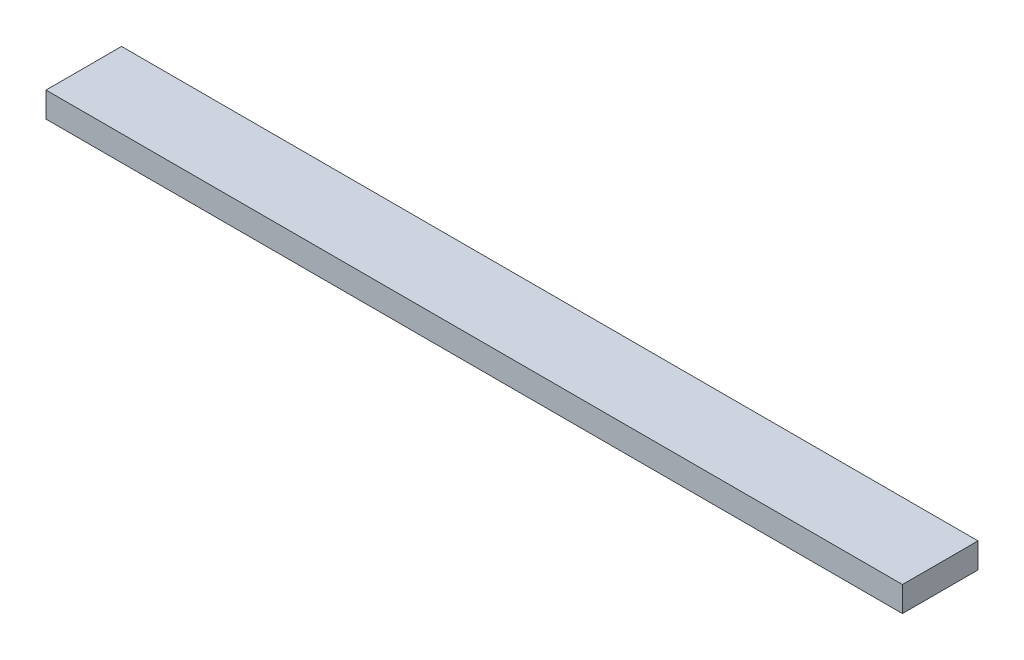
ISO-10303-21;
HEADER;
FILE_DESCRIPTION(('STEP AP214'),'2;1');
FILE_NAME('part.step','',(''),(''),'','','');
FILE_SCHEMA(('AUTOMOTIVE_DESIGN { 1 0 10303 214 1 1 1 1 }'));
ENDSEC;
DATA;
#1=APPLICATION_CONTEXT('core data for automotive mechanical design processes');
#2=APPLICATION_PROTOCOL_DEFINITION('international standard','automotive_design',2000,#1);
#3=PRODUCT_CONTEXT('',#1,'mechanical');
#4=PRODUCT('Part','Part','',(#3));
#5=PRODUCT_RELATED_PRODUCT_CATEGORY('part','',(#4));
#6=PRODUCT_DEFINITION_FORMATION('','',#4);
#7=PRODUCT_DEFINITION_CONTEXT('part definition',#1,'design');
#8=PRODUCT_DEFINITION('design','',#6,#7);
#9=PRODUCT_DEFINITION_SHAPE('','',#8);
#10=(LENGTH_UNIT() NAMED_UNIT(*) SI_UNIT(.MILLI.,.METRE.));
#11=(NAMED_UNIT(*) PLANE_ANGLE_UNIT() SI_UNIT($,.RADIAN.));
#12=(NAMED_UNIT(*) SI_UNIT($,.STERADIAN.) SOLID_ANGLE_UNIT());
#13=UNCERTAINTY_MEASURE_WITH_UNIT(LENGTH_MEASURE(1.E-05),#10,'distance_accuracy_value','');
#14=(GEOMETRIC_REPRESENTATION_CONTEXT(3) GLOBAL_UNCERTAINTY_ASSIGNED_CONTEXT((#13)) GLOBAL_UNIT_ASSIGNED_CONTEXT((#10,
#11,#12)) REPRESENTATION_CONTEXT('',''));
#15=CARTESIAN_POINT('',(0.,0.,0.));
#16=DIRECTION('',(0.,0.,1.));
#17=DIRECTION('',(1.,0.,0.));
#18=AXIS2_PLACEMENT_3D('',#15,#16,#17);
#19=CARTESIAN_POINT('',(0.,5.,0.));
#20=DIRECTION('',(1.,0.,0.));
#21=DIRECTION('',(0.,0.,-1.));
#22=AXIS2_PLACEMENT_3D('',#19,#20,#21);
#23=PLANE('',#22);
#24=DIRECTION('',(0.,0.,1.));
#25=VECTOR('',#24,1.);
#26=CARTESIAN_POINT('',(0.,0.,0.));
#27=LINE('',#26,#25);
#28=CARTESIAN_POINT('',(0.,0.,-15.));
#29=VERTEX_POINT('',#28);
#30=CARTESIAN_POINT('',(0.,0.,0.));
#31=VERTEX_POINT('',#30);
#32=EDGE_CURVE('E98',#29,#31,#27,.T.);
#33=ORIENTED_EDGE('',*,*,#32,.T.);
#34=DIRECTION('',(0.,-1.,0.));
#35=VECTOR('',#34,1.);
#36=CARTESIAN_POINT('',(0.,5.,0.));
#37=LINE('',#36,#35);
#38=CARTESIAN_POINT('',(0.,5.,0.));
#39=VERTEX_POINT('',#38);
#40=EDGE_CURVE('E11',#39,#31,#37,.T.);
#41=ORIENTED_EDGE('',*,*,#40,.F.);
#42=DIRECTION('',(0.,0.,1.));
#43=VECTOR('',#42,1.);
#44=CARTESIAN_POINT('',(0.,5.,0.));
#45=LINE('',#44,#43);
#46=CARTESIAN_POINT('',(0.,5.,-15.));
#47=VERTEX_POINT('',#46);
#48=EDGE_CURVE('E86',#47,#39,#45,.T.);
#49=ORIENTED_EDGE('',*,*,#48,.F.);
#50=DIRECTION('',(0.,-1.,0.));
#51=VECTOR('',#50,1.);
#52=CARTESIAN_POINT('',(0.,5.,-15.));
#53=LINE('',#52,#51);
#54=EDGE_CURVE('E94',#47,#29,#53,.T.);
#55=ORIENTED_EDGE('',*,*,#54,.T.);
#56=EDGE_LOOP('',(#33,#41,#49,#55));
#57=FACE_BOUND('',#56,.T.);
#58=ADVANCED_FACE('F35',(#57),#23,.F.);
#59=CARTESIAN_POINT('',(0.,5.,0.));
#60=DIRECTION('',(0.,0.,-1.));
#61=DIRECTION('',(-1.,0.,0.));
#62=AXIS2_PLACEMENT_3D('',#59,#60,#61);
#63=PLANE('',#62);
#64=DIRECTION('',(1.,0.,0.));
#65=VECTOR('',#64,1.);
#66=CARTESIAN_POINT('',(0.,0.,0.));
#67=LINE('',#66,#65);
#68=CARTESIAN_POINT('',(170.,0.,0.));
#69=VERTEX_POINT('',#68);
#70=EDGE_CURVE('E90',#31,#69,#67,.T.);
#71=ORIENTED_EDGE('',*,*,#70,.T.);
#72=DIRECTION('',(0.,-1.,0.));
#73=VECTOR('',#72,1.);
#74=CARTESIAN_POINT('',(170.,5.,0.));
#75=LINE('',#74,#73);
#76=CARTESIAN_POINT('',(170.,5.,0.));
#77=VERTEX_POINT('',#76);
#78=EDGE_CURVE('E43',#77,#69,#75,.T.);
#79=ORIENTED_EDGE('',*,*,#78,.F.);
#80=DIRECTION('',(1.,0.,0.));
#81=VECTOR('',#80,1.);
#82=CARTESIAN_POINT('',(0.,5.,0.));
#83=LINE('',#82,#81);
#84=EDGE_CURVE('E81',#39,#77,#83,.T.);
#85=ORIENTED_EDGE('',*,*,#84,.F.);
#86=ORIENTED_EDGE('',*,*,#40,.T.);
#87=EDGE_LOOP('',(#71,#79,#85,#86));
#88=FACE_BOUND('',#87,.T.);
#89=ADVANCED_FACE('F89',(#88),#63,.F.);
#90=CARTESIAN_POINT('',(170.,5.,0.));
#91=DIRECTION('',(-1.,0.,0.));
#92=DIRECTION('',(0.,0.,1.));
#93=AXIS2_PLACEMENT_3D('',#90,#91,#92);
#94=PLANE('',#93);
#95=DIRECTION('',(0.,0.,-1.));
#96=VECTOR('',#95,1.);
#97=CARTESIAN_POINT('',(170.,0.,0.));
#98=LINE('',#97,#96);
#99=CARTESIAN_POINT('',(170.,0.,-15.));
#100=VERTEX_POINT('',#99);
#101=EDGE_CURVE('E68',#69,#100,#98,.T.);
#102=ORIENTED_EDGE('',*,*,#101,.T.);
#103=DIRECTION('',(0.,-1.,0.));
#104=VECTOR('',#103,1.);
#105=CARTESIAN_POINT('',(170.,5.,-15.));
#106=LINE('',#105,#104);
#107=CARTESIAN_POINT('',(170.,5.,-15.));
#108=VERTEX_POINT('',#107);
#109=EDGE_CURVE('E91',#108,#100,#106,.T.);
#110=ORIENTED_EDGE('',*,*,#109,.F.);
#111=DIRECTION('',(0.,0.,-1.));
#112=VECTOR('',#111,1.);
#113=CARTESIAN_POINT('',(170.,5.,0.));
#114=LINE('',#113,#112);
#115=EDGE_CURVE('E84',#77,#108,#114,.T.);
#116=ORIENTED_EDGE('',*,*,#115,.F.);
#117=ORIENTED_EDGE('',*,*,#78,.T.);
#118=EDGE_LOOP('',(#102,#110,#116,#117));
#119=FACE_BOUND('',#118,.T.);
#120=ADVANCED_FACE('F92',(#119),#94,.F.);
#121=CARTESIAN_POINT('',(0.,5.,-15.));
#122=DIRECTION('',(0.,0.,1.));
#123=DIRECTION('',(1.,0.,0.));
#124=AXIS2_PLACEMENT_3D('',#121,#122,#123);
#125=PLANE('',#124);
#126=DIRECTION('',(-1.,0.,0.));
#127=VECTOR('',#126,1.);
#128=CARTESIAN_POINT('',(0.,0.,-15.));
#129=LINE('',#128,#127);
#130=EDGE_CURVE('E74',#100,#29,#129,.T.);
#131=ORIENTED_EDGE('',*,*,#130,.T.);
#132=ORIENTED_EDGE('',*,*,#54,.F.);
#133=DIRECTION('',(-1.,0.,0.));
#134=VECTOR('',#133,1.);
#135=CARTESIAN_POINT('',(0.,5.,-15.));
#136=LINE('',#135,#134);
#137=EDGE_CURVE('E51',#108,#47,#136,.T.);
#138=ORIENTED_EDGE('',*,*,#137,.F.);
#139=ORIENTED_EDGE('',*,*,#109,.T.);
#140=EDGE_LOOP('',(#131,#132,#138,#139));
#141=FACE_BOUND('',#140,.T.);
#142=ADVANCED_FACE('F105',(#141),#125,.F.);
#143=CARTESIAN_POINT('',(0.,5.,0.));
#144=DIRECTION('',(0.,-1.,0.));
#145=DIRECTION('',(0.,0.,-1.));
#146=AXIS2_PLACEMENT_3D('',#143,#144,#145);
#147=PLANE('',#146);
#148=ORIENTED_EDGE('',*,*,#48,.T.);
#149=ORIENTED_EDGE('',*,*,#84,.T.);
#150=ORIENTED_EDGE('',*,*,#115,.T.);
#151=ORIENTED_EDGE('',*,*,#137,.T.);
#152=EDGE_LOOP('',(#148,#149,#150,#151));
#153=FACE_BOUND('',#152,.T.);
#154=ADVANCED_FACE('F82',(#153),#147,.F.);
#155=CARTESIAN_POINT('',(0.,0.,0.));
#156=DIRECTION('',(0.,-1.,0.));
#157=DIRECTION('',(0.,0.,-1.));
#158=AXIS2_PLACEMENT_3D('',#155,#156,#157);
#159=PLANE('',#158);
#160=ORIENTED_EDGE('',*,*,#32,.F.);
#161=ORIENTED_EDGE('',*,*,#130,.F.);
#162=ORIENTED_EDGE('',*,*,#101,.F.);
#163=ORIENTED_EDGE('',*,*,#70,.F.);
#164=EDGE_LOOP('',(#160,#161,#162,#163));
#165=FACE_BOUND('',#164,.T.);
#166=ADVANCED_FACE('F108',(#165),#159,.T.);
#167=CLOSED_SHELL('',(#58,#89,#120,#142,#154,#166));
#168=MANIFOLD_SOLID_BREP('B2',#167);
#169=ADVANCED_BREP_SHAPE_REPRESENTATION('',(#18,#168),#14);
#170=SHAPE_DEFINITION_REPRESENTATION(#9,#169);
ENDSEC;
END-ISO-10303-21;
